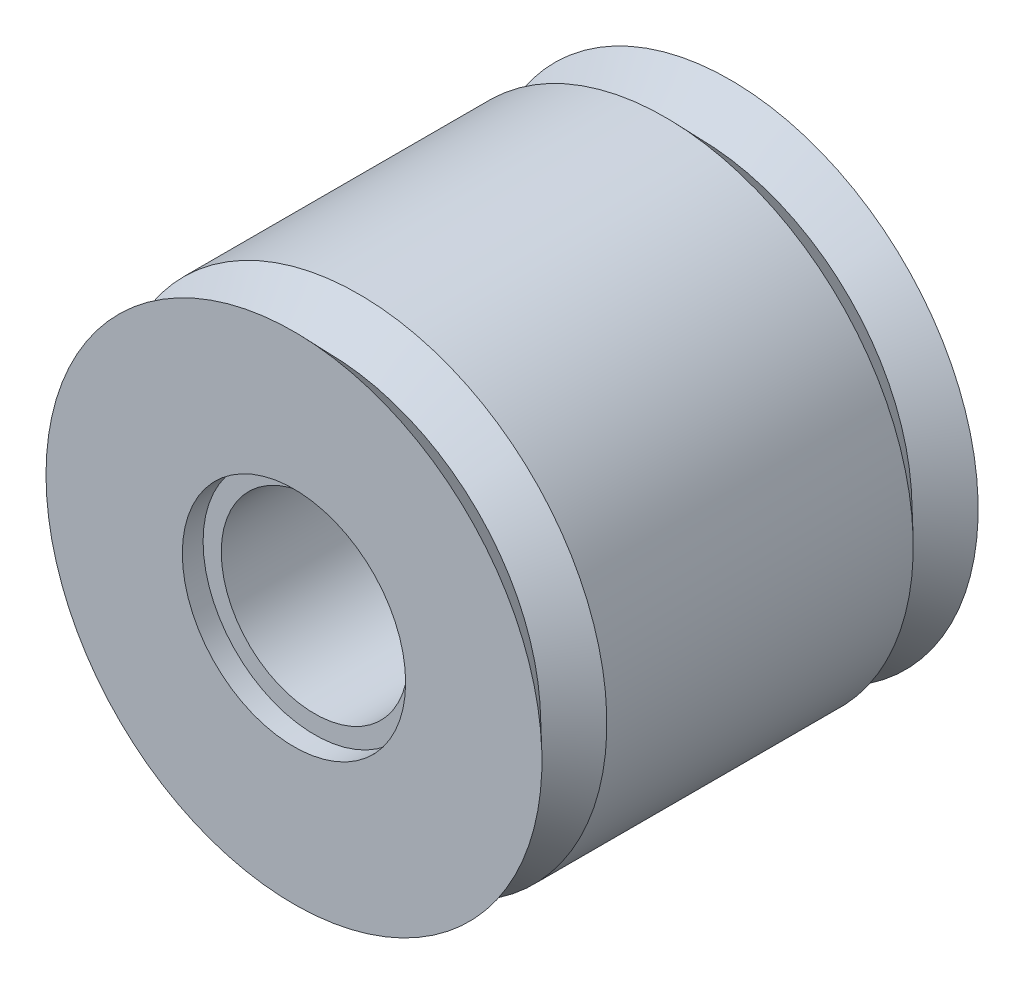
ISO-10303-21;
HEADER;
FILE_DESCRIPTION(('STEP AP214'),'2;1');
FILE_NAME('part.step','',(''),(''),'','','');
FILE_SCHEMA(('AUTOMOTIVE_DESIGN { 1 0 10303 214 1 1 1 1 }'));
ENDSEC;
DATA;
#1=APPLICATION_CONTEXT('core data for automotive mechanical design processes');
#2=APPLICATION_PROTOCOL_DEFINITION('international standard','automotive_design',2000,#1);
#3=PRODUCT_CONTEXT('',#1,'mechanical');
#4=PRODUCT('Part','Part','',(#3));
#5=PRODUCT_RELATED_PRODUCT_CATEGORY('part','',(#4));
#6=PRODUCT_DEFINITION_FORMATION('','',#4);
#7=PRODUCT_DEFINITION_CONTEXT('part definition',#1,'design');
#8=PRODUCT_DEFINITION('design','',#6,#7);
#9=PRODUCT_DEFINITION_SHAPE('','',#8);
#10=(LENGTH_UNIT() NAMED_UNIT(*) SI_UNIT(.MILLI.,.METRE.));
#11=(NAMED_UNIT(*) PLANE_ANGLE_UNIT() SI_UNIT($,.RADIAN.));
#12=(NAMED_UNIT(*) SI_UNIT($,.STERADIAN.) SOLID_ANGLE_UNIT());
#13=UNCERTAINTY_MEASURE_WITH_UNIT(LENGTH_MEASURE(1.E-05),#10,'distance_accuracy_value','');
#14=(GEOMETRIC_REPRESENTATION_CONTEXT(3) GLOBAL_UNCERTAINTY_ASSIGNED_CONTEXT((#13)) GLOBAL_UNIT_ASSIGNED_CONTEXT((#10,
#11,#12)) REPRESENTATION_CONTEXT('',''));
#15=CARTESIAN_POINT('',(0.,0.,0.));
#16=DIRECTION('',(0.,0.,1.));
#17=DIRECTION('',(1.,0.,0.));
#18=AXIS2_PLACEMENT_3D('',#15,#16,#17);
#19=CARTESIAN_POINT('',(0.,0.,8.4));
#20=DIRECTION('',(0.,0.,-1.));
#21=DIRECTION('',(-1.,0.,0.));
#22=AXIS2_PLACEMENT_3D('',#19,#20,#21);
#23=CYLINDRICAL_SURFACE('',#22,3.6);
#24=CARTESIAN_POINT('',(0.,0.,7.6));
#25=DIRECTION('',(0.,0.,1.));
#26=DIRECTION('',(1.,0.,0.));
#27=AXIS2_PLACEMENT_3D('',#24,#25,#26);
#28=CIRCLE('',#27,3.6);
#29=CARTESIAN_POINT('',(3.6,0.,7.6));
#30=VERTEX_POINT('',#29);
#31=EDGE_CURVE('E10',#30,#30,#28,.T.);
#32=ORIENTED_EDGE('',*,*,#31,.T.);
#33=EDGE_LOOP('',(#32));
#34=FACE_BOUND('',#33,.T.);
#35=CARTESIAN_POINT('',(0.,0.,-7.6));
#36=DIRECTION('',(0.,0.,-1.));
#37=DIRECTION('',(-1.,0.,0.));
#38=AXIS2_PLACEMENT_3D('',#35,#36,#37);
#39=CIRCLE('',#38,3.6);
#40=CARTESIAN_POINT('',(-3.6,0.,-7.6));
#41=VERTEX_POINT('',#40);
#42=EDGE_CURVE('E37',#41,#41,#39,.T.);
#43=ORIENTED_EDGE('',*,*,#42,.T.);
#44=EDGE_LOOP('',(#43));
#45=FACE_BOUND('',#44,.T.);
#46=ADVANCED_FACE('F33',(#34,#45),#23,.F.);
#47=CARTESIAN_POINT('',(0.,0.,8.4));
#48=DIRECTION('',(0.,0.,1.));
#49=DIRECTION('',(1.,0.,0.));
#50=AXIS2_PLACEMENT_3D('',#47,#48,#49);
#51=PLANE('',#50);
#52=CARTESIAN_POINT('',(0.,0.,8.4));
#53=DIRECTION('',(0.,0.,1.));
#54=DIRECTION('',(1.,0.,0.));
#55=AXIS2_PLACEMENT_3D('',#52,#53,#54);
#56=CIRCLE('',#55,4.3);
#57=CARTESIAN_POINT('',(4.3,0.,8.4));
#58=VERTEX_POINT('',#57);
#59=EDGE_CURVE('E45',#58,#58,#56,.T.);
#60=ORIENTED_EDGE('',*,*,#59,.F.);
#61=EDGE_LOOP('',(#60));
#62=FACE_BOUND('',#61,.T.);
#63=CARTESIAN_POINT('',(0.,0.,8.4));
#64=DIRECTION('',(0.,0.,-1.));
#65=DIRECTION('',(-1.,0.,0.));
#66=AXIS2_PLACEMENT_3D('',#63,#64,#65);
#67=CIRCLE('',#66,9.55);
#68=CARTESIAN_POINT('',(-9.55,0.,8.4));
#69=VERTEX_POINT('',#68);
#70=EDGE_CURVE('E56',#69,#69,#67,.T.);
#71=ORIENTED_EDGE('',*,*,#70,.F.);
#72=EDGE_LOOP('',(#71));
#73=FACE_BOUND('',#72,.T.);
#74=ADVANCED_FACE('F93',(#62,#73),#51,.T.);
#75=CARTESIAN_POINT('',(0.,0.,-8.4));
#76=DIRECTION('',(0.,0.,1.));
#77=DIRECTION('',(1.,0.,0.));
#78=AXIS2_PLACEMENT_3D('',#75,#76,#77);
#79=PLANE('',#78);
#80=CARTESIAN_POINT('',(0.,0.,-8.4));
#81=DIRECTION('',(0.,0.,1.));
#82=DIRECTION('',(1.,0.,0.));
#83=AXIS2_PLACEMENT_3D('',#80,#81,#82);
#84=CIRCLE('',#83,4.3);
#85=CARTESIAN_POINT('',(4.3,0.,-8.4));
#86=VERTEX_POINT('',#85);
#87=EDGE_CURVE('E59',#86,#86,#84,.T.);
#88=ORIENTED_EDGE('',*,*,#87,.T.);
#89=EDGE_LOOP('',(#88));
#90=FACE_BOUND('',#89,.T.);
#91=CARTESIAN_POINT('',(0.,0.,-8.4));
#92=DIRECTION('',(0.,0.,-1.));
#93=DIRECTION('',(-1.,0.,0.));
#94=AXIS2_PLACEMENT_3D('',#91,#92,#93);
#95=CIRCLE('',#94,9.55);
#96=CARTESIAN_POINT('',(-9.55,0.,-8.4));
#97=VERTEX_POINT('',#96);
#98=EDGE_CURVE('E71',#97,#97,#95,.T.);
#99=ORIENTED_EDGE('',*,*,#98,.T.);
#100=EDGE_LOOP('',(#99));
#101=FACE_BOUND('',#100,.T.);
#102=ADVANCED_FACE('F75',(#90,#101),#79,.F.);
#103=CARTESIAN_POINT('',(0.,0.,8.4));
#104=DIRECTION('',(0.,0.,-1.));
#105=DIRECTION('',(-1.,0.,0.));
#106=AXIS2_PLACEMENT_3D('',#103,#104,#105);
#107=CYLINDRICAL_SURFACE('',#106,9.55);
#108=CARTESIAN_POINT('',(0.,0.,-5.9));
#109=DIRECTION('',(0.,0.,-1.));
#110=DIRECTION('',(-1.,0.,0.));
#111=AXIS2_PLACEMENT_3D('',#108,#109,#110);
#112=CIRCLE('',#111,9.55);
#113=CARTESIAN_POINT('',(-9.55,0.,-5.9));
#114=VERTEX_POINT('',#113);
#115=EDGE_CURVE('E68',#114,#114,#112,.T.);
#116=ORIENTED_EDGE('',*,*,#115,.F.);
#117=EDGE_LOOP('',(#116));
#118=FACE_BOUND('',#117,.T.);
#119=CARTESIAN_POINT('',(0.,0.,5.9));
#120=DIRECTION('',(0.,0.,-1.));
#121=DIRECTION('',(-1.,0.,0.));
#122=AXIS2_PLACEMENT_3D('',#119,#120,#121);
#123=CIRCLE('',#122,9.55);
#124=CARTESIAN_POINT('',(-9.55,0.,5.9));
#125=VERTEX_POINT('',#124);
#126=EDGE_CURVE('E53',#125,#125,#123,.T.);
#127=ORIENTED_EDGE('',*,*,#126,.T.);
#128=EDGE_LOOP('',(#127));
#129=FACE_BOUND('',#128,.T.);
#130=ADVANCED_FACE('F35',(#118,#129),#107,.T.);
#131=CARTESIAN_POINT('',(0.,0.,7.6));
#132=DIRECTION('',(0.,0.,1.));
#133=DIRECTION('',(1.,0.,0.));
#134=AXIS2_PLACEMENT_3D('',#131,#132,#133);
#135=CYLINDRICAL_SURFACE('',#134,4.3);
#136=CARTESIAN_POINT('',(0.,0.,7.6));
#137=DIRECTION('',(0.,0.,1.));
#138=DIRECTION('',(1.,0.,0.));
#139=AXIS2_PLACEMENT_3D('',#136,#137,#138);
#140=CIRCLE('',#139,4.3);
#141=CARTESIAN_POINT('',(4.3,0.,7.6));
#142=VERTEX_POINT('',#141);
#143=EDGE_CURVE('E41',#142,#142,#140,.T.);
#144=ORIENTED_EDGE('',*,*,#143,.F.);
#145=EDGE_LOOP('',(#144));
#146=FACE_BOUND('',#145,.T.);
#147=ORIENTED_EDGE('',*,*,#59,.T.);
#148=EDGE_LOOP('',(#147));
#149=FACE_BOUND('',#148,.T.);
#150=ADVANCED_FACE('F102',(#146,#149),#135,.F.);
#151=CARTESIAN_POINT('',(0.,0.,7.6));
#152=DIRECTION('',(0.,0.,1.));
#153=DIRECTION('',(1.,0.,0.));
#154=AXIS2_PLACEMENT_3D('',#151,#152,#153);
#155=PLANE('',#154);
#156=ORIENTED_EDGE('',*,*,#31,.F.);
#157=EDGE_LOOP('',(#156));
#158=FACE_BOUND('',#157,.T.);
#159=ORIENTED_EDGE('',*,*,#143,.T.);
#160=EDGE_LOOP('',(#159));
#161=FACE_BOUND('',#160,.T.);
#162=ADVANCED_FACE('F124',(#158,#161),#155,.T.);
#163=CARTESIAN_POINT('',(0.,0.,8.4));
#164=DIRECTION('',(0.,0.,1.));
#165=DIRECTION('',(1.,0.,0.));
#166=AXIS2_PLACEMENT_3D('',#163,#164,#165);
#167=CONICAL_SURFACE('',#166,9.55,0.805003494254654);
#168=CARTESIAN_POINT('',(0.,0.,7.15));
#169=DIRECTION('',(0.,0.,-1.));
#170=DIRECTION('',(-1.,0.,0.));
#171=AXIS2_PLACEMENT_3D('',#168,#169,#170);
#172=CIRCLE('',#171,8.25);
#173=CARTESIAN_POINT('',(-8.25,0.,7.15));
#174=VERTEX_POINT('',#173);
#175=EDGE_CURVE('E49',#174,#174,#172,.T.);
#176=ORIENTED_EDGE('',*,*,#175,.F.);
#177=EDGE_LOOP('',(#176));
#178=FACE_BOUND('',#177,.T.);
#179=ORIENTED_EDGE('',*,*,#70,.T.);
#180=EDGE_LOOP('',(#179));
#181=FACE_BOUND('',#180,.T.);
#182=ADVANCED_FACE('F119',(#178,#181),#167,.T.);
#183=CARTESIAN_POINT('',(0.,0.,7.15));
#184=DIRECTION('',(0.,0.,-1.));
#185=DIRECTION('',(-1.,0.,0.));
#186=AXIS2_PLACEMENT_3D('',#183,#184,#185);
#187=CONICAL_SURFACE('',#186,8.25,0.805003494254653);
#188=ORIENTED_EDGE('',*,*,#126,.F.);
#189=EDGE_LOOP('',(#188));
#190=FACE_BOUND('',#189,.T.);
#191=ORIENTED_EDGE('',*,*,#175,.T.);
#192=EDGE_LOOP('',(#191));
#193=FACE_BOUND('',#192,.T.);
#194=ADVANCED_FACE('F113',(#190,#193),#187,.T.);
#195=CARTESIAN_POINT('',(0.,0.,-7.6));
#196=DIRECTION('',(0.,0.,-1.));
#197=DIRECTION('',(-1.,0.,0.));
#198=AXIS2_PLACEMENT_3D('',#195,#196,#197);
#199=CYLINDRICAL_SURFACE('',#198,4.3);
#200=CARTESIAN_POINT('',(0.,0.,-7.6));
#201=DIRECTION('',(0.,0.,1.));
#202=DIRECTION('',(1.,0.,0.));
#203=AXIS2_PLACEMENT_3D('',#200,#201,#202);
#204=CIRCLE('',#203,4.3);
#205=CARTESIAN_POINT('',(4.3,0.,-7.6));
#206=VERTEX_POINT('',#205);
#207=EDGE_CURVE('E62',#206,#206,#204,.T.);
#208=ORIENTED_EDGE('',*,*,#207,.T.);
#209=EDGE_LOOP('',(#208));
#210=FACE_BOUND('',#209,.T.);
#211=ORIENTED_EDGE('',*,*,#87,.F.);
#212=EDGE_LOOP('',(#211));
#213=FACE_BOUND('',#212,.T.);
#214=ADVANCED_FACE('F89',(#210,#213),#199,.F.);
#215=CARTESIAN_POINT('',(0.,0.,-7.6));
#216=DIRECTION('',(0.,0.,-1.));
#217=DIRECTION('',(1.,0.,0.));
#218=AXIS2_PLACEMENT_3D('',#215,#216,#217);
#219=PLANE('',#218);
#220=ORIENTED_EDGE('',*,*,#42,.F.);
#221=EDGE_LOOP('',(#220));
#222=FACE_BOUND('',#221,.T.);
#223=ORIENTED_EDGE('',*,*,#207,.F.);
#224=EDGE_LOOP('',(#223));
#225=FACE_BOUND('',#224,.T.);
#226=ADVANCED_FACE('F80',(#222,#225),#219,.T.);
#227=CARTESIAN_POINT('',(0.,0.,-8.4));
#228=DIRECTION('',(0.,0.,-1.));
#229=DIRECTION('',(1.,0.,0.));
#230=AXIS2_PLACEMENT_3D('',#227,#228,#229);
#231=CONICAL_SURFACE('',#230,9.55,0.805003494254654);
#232=CARTESIAN_POINT('',(0.,0.,-7.15));
#233=DIRECTION('',(0.,0.,-1.));
#234=DIRECTION('',(-1.,0.,0.));
#235=AXIS2_PLACEMENT_3D('',#232,#233,#234);
#236=CIRCLE('',#235,8.25);
#237=CARTESIAN_POINT('',(-8.25,0.,-7.15));
#238=VERTEX_POINT('',#237);
#239=EDGE_CURVE('E63',#238,#238,#236,.T.);
#240=ORIENTED_EDGE('',*,*,#239,.T.);
#241=EDGE_LOOP('',(#240));
#242=FACE_BOUND('',#241,.T.);
#243=ORIENTED_EDGE('',*,*,#98,.F.);
#244=EDGE_LOOP('',(#243));
#245=FACE_BOUND('',#244,.T.);
#246=ADVANCED_FACE('F77',(#242,#245),#231,.T.);
#247=CARTESIAN_POINT('',(0.,0.,-7.15));
#248=DIRECTION('',(0.,0.,1.));
#249=DIRECTION('',(-1.,0.,0.));
#250=AXIS2_PLACEMENT_3D('',#247,#248,#249);
#251=CONICAL_SURFACE('',#250,8.25,0.805003494254653);
#252=ORIENTED_EDGE('',*,*,#115,.T.);
#253=EDGE_LOOP('',(#252));
#254=FACE_BOUND('',#253,.T.);
#255=ORIENTED_EDGE('',*,*,#239,.F.);
#256=EDGE_LOOP('',(#255));
#257=FACE_BOUND('',#256,.T.);
#258=ADVANCED_FACE('F79',(#254,#257),#251,.T.);
#259=CLOSED_SHELL('',(#46,#74,#102,#130,#150,#162,#182,#194,#214,#226,#246,#258));
#260=MANIFOLD_SOLID_BREP('B2',#259);
#261=ADVANCED_BREP_SHAPE_REPRESENTATION('',(#18,#260),#14);
#262=SHAPE_DEFINITION_REPRESENTATION(#9,#261);
ENDSEC;
END-ISO-10303-21;
